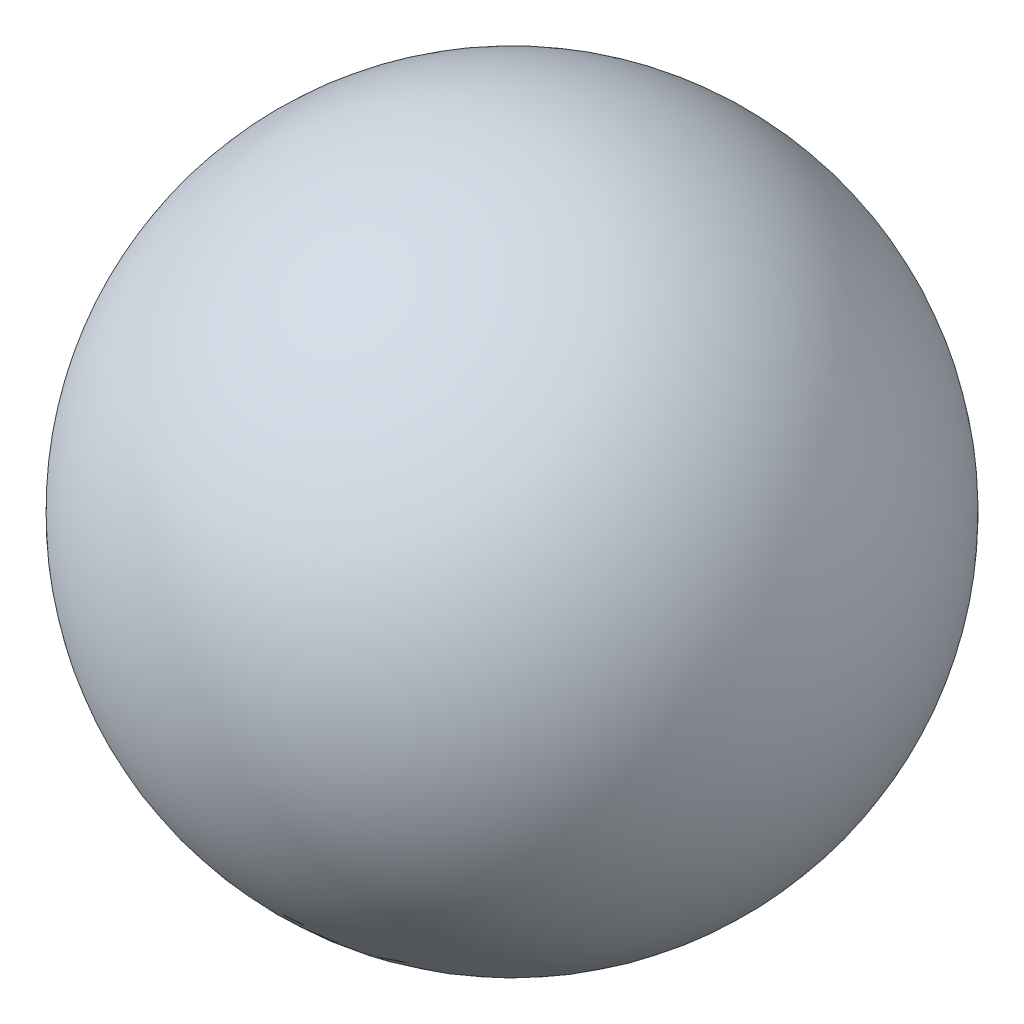
ISO-10303-21;
HEADER;
FILE_DESCRIPTION(('STEP AP214'),'2;1');
FILE_NAME('part.step','',(''),(''),'','','');
FILE_SCHEMA(('AUTOMOTIVE_DESIGN { 1 0 10303 214 1 1 1 1 }'));
ENDSEC;
DATA;
#1=APPLICATION_CONTEXT('core data for automotive mechanical design processes');
#2=APPLICATION_PROTOCOL_DEFINITION('international standard','automotive_design',2000,#1);
#3=PRODUCT_CONTEXT('',#1,'mechanical');
#4=PRODUCT('Part','Part','',(#3));
#5=PRODUCT_RELATED_PRODUCT_CATEGORY('part','',(#4));
#6=PRODUCT_DEFINITION_FORMATION('','',#4);
#7=PRODUCT_DEFINITION_CONTEXT('part definition',#1,'design');
#8=PRODUCT_DEFINITION('design','',#6,#7);
#9=PRODUCT_DEFINITION_SHAPE('','',#8);
#10=(LENGTH_UNIT() NAMED_UNIT(*) SI_UNIT(.MILLI.,.METRE.));
#11=(NAMED_UNIT(*) PLANE_ANGLE_UNIT() SI_UNIT($,.RADIAN.));
#12=(NAMED_UNIT(*) SI_UNIT($,.STERADIAN.) SOLID_ANGLE_UNIT());
#13=UNCERTAINTY_MEASURE_WITH_UNIT(LENGTH_MEASURE(1.E-05),#10,'distance_accuracy_value','');
#14=(GEOMETRIC_REPRESENTATION_CONTEXT(3) GLOBAL_UNCERTAINTY_ASSIGNED_CONTEXT((#13)) GLOBAL_UNIT_ASSIGNED_CONTEXT((#10,
#11,#12)) REPRESENTATION_CONTEXT('',''));
#15=CARTESIAN_POINT('',(0.,0.,0.));
#16=DIRECTION('',(0.,0.,1.));
#17=DIRECTION('',(1.,0.,0.));
#18=AXIS2_PLACEMENT_3D('',#15,#16,#17);
#19=CARTESIAN_POINT('',(49.75,33.0873038954307,41.4026245687567));
#20=DIRECTION('',(0.,0.624294642316075,0.781188965344138));
#21=DIRECTION('',(0.173648177666934,-0.769320949638491,0.614810203916853));
#22=AXIS2_PLACEMENT_3D('',#19,#20,#21);
#23=SPHERICAL_SURFACE('',#22,5.95);
#24=CARTESIAN_POINT('',(49.75,36.8018570172113,46.0506989125543));
#25=VERTEX_POINT('',#24);
#26=VERTEX_LOOP('',#25);
#27=FACE_BOUND('',#26,.T.);
#28=CARTESIAN_POINT('',(49.75,29.3727507736501,36.7545502249591));
#29=VERTEX_POINT('',#28);
#30=VERTEX_LOOP('',#29);
#31=FACE_BOUND('',#30,.T.);
#32=ADVANCED_FACE('F16',(#27,#31),#23,.T.);
#33=CLOSED_SHELL('',(#32));
#34=MANIFOLD_SOLID_BREP('B1',#33);
#35=ADVANCED_BREP_SHAPE_REPRESENTATION('',(#18,#34),#14);
#36=SHAPE_DEFINITION_REPRESENTATION(#9,#35);
ENDSEC;
END-ISO-10303-21;
